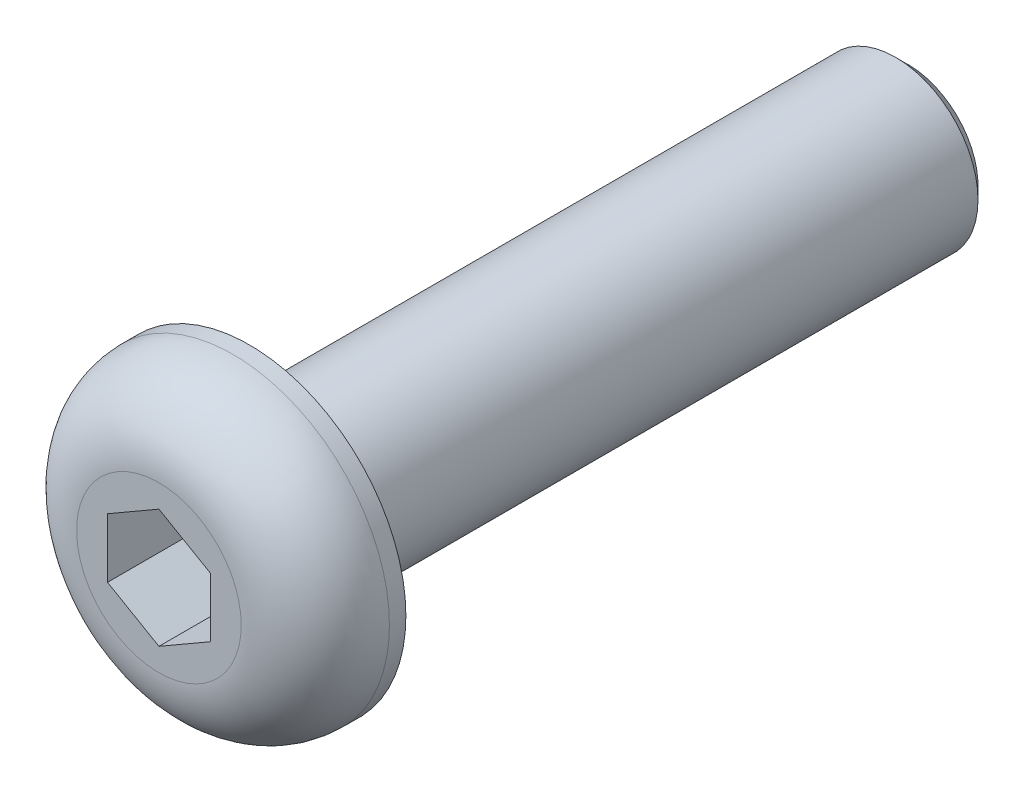
ISO-10303-21;
HEADER;
FILE_DESCRIPTION(('STEP AP214'),'2;1');
FILE_NAME('part.step','',(''),(''),'','','');
FILE_SCHEMA(('AUTOMOTIVE_DESIGN { 1 0 10303 214 1 1 1 1 }'));
ENDSEC;
DATA;
#1=APPLICATION_CONTEXT('core data for automotive mechanical design processes');
#2=APPLICATION_PROTOCOL_DEFINITION('international standard','automotive_design',2000,#1);
#3=PRODUCT_CONTEXT('',#1,'mechanical');
#4=PRODUCT('Part','Part','',(#3));
#5=PRODUCT_RELATED_PRODUCT_CATEGORY('part','',(#4));
#6=PRODUCT_DEFINITION_FORMATION('','',#4);
#7=PRODUCT_DEFINITION_CONTEXT('part definition',#1,'design');
#8=PRODUCT_DEFINITION('design','',#6,#7);
#9=PRODUCT_DEFINITION_SHAPE('','',#8);
#10=(LENGTH_UNIT() NAMED_UNIT(*) SI_UNIT(.MILLI.,.METRE.));
#11=(NAMED_UNIT(*) PLANE_ANGLE_UNIT() SI_UNIT($,.RADIAN.));
#12=(NAMED_UNIT(*) SI_UNIT($,.STERADIAN.) SOLID_ANGLE_UNIT());
#13=UNCERTAINTY_MEASURE_WITH_UNIT(LENGTH_MEASURE(1.E-05),#10,'distance_accuracy_value','');
#14=(GEOMETRIC_REPRESENTATION_CONTEXT(3) GLOBAL_UNCERTAINTY_ASSIGNED_CONTEXT((#13)) GLOBAL_UNIT_ASSIGNED_CONTEXT((#10,
#11,#12)) REPRESENTATION_CONTEXT('',''));
#15=CARTESIAN_POINT('',(0.,0.,0.));
#16=DIRECTION('',(0.,0.,1.));
#17=DIRECTION('',(1.,0.,0.));
#18=AXIS2_PLACEMENT_3D('',#15,#16,#17);
#19=CARTESIAN_POINT('',(0.,0.,0.));
#20=DIRECTION('',(0.,0.,1.));
#21=DIRECTION('',(1.,0.,0.));
#22=AXIS2_PLACEMENT_3D('',#19,#20,#21);
#23=PLANE('',#22);
#24=CARTESIAN_POINT('',(0.,0.,0.));
#25=DIRECTION('',(0.,0.,1.));
#26=DIRECTION('',(1.,0.,0.));
#27=AXIS2_PLACEMENT_3D('',#24,#25,#26);
#28=CIRCLE('',#27,3.8);
#29=CARTESIAN_POINT('',(3.8,0.,0.));
#30=VERTEX_POINT('',#29);
#31=EDGE_CURVE('E137',#30,#30,#28,.T.);
#32=ORIENTED_EDGE('',*,*,#31,.F.);
#33=EDGE_LOOP('',(#32));
#34=FACE_BOUND('',#33,.T.);
#35=CARTESIAN_POINT('',(0.,0.,0.));
#36=DIRECTION('',(0.,0.,1.));
#37=DIRECTION('',(1.,0.,0.));
#38=AXIS2_PLACEMENT_3D('',#35,#36,#37);
#39=CIRCLE('',#38,2.);
#40=CARTESIAN_POINT('',(2.,0.,0.));
#41=VERTEX_POINT('',#40);
#42=EDGE_CURVE('E145',#41,#41,#39,.F.);
#43=ORIENTED_EDGE('',*,*,#42,.F.);
#44=EDGE_LOOP('',(#43));
#45=FACE_BOUND('',#44,.T.);
#46=ADVANCED_FACE('F35',(#34,#45),#23,.F.);
#47=CARTESIAN_POINT('',(0.,0.,2.2));
#48=DIRECTION('',(0.,0.,-1.));
#49=DIRECTION('',(-1.,0.,0.));
#50=AXIS2_PLACEMENT_3D('',#47,#48,#49);
#51=CYLINDRICAL_SURFACE('',#50,3.8);
#52=CARTESIAN_POINT('',(0.,0.,0.4));
#53=DIRECTION('',(0.,0.,1.));
#54=DIRECTION('',(1.,0.,0.));
#55=AXIS2_PLACEMENT_3D('',#52,#53,#54);
#56=CIRCLE('',#55,3.8);
#57=CARTESIAN_POINT('',(3.8,0.,0.4));
#58=VERTEX_POINT('',#57);
#59=EDGE_CURVE('E11',#58,#58,#56,.F.);
#60=ORIENTED_EDGE('',*,*,#59,.T.);
#61=EDGE_LOOP('',(#60));
#62=FACE_BOUND('',#61,.T.);
#63=ORIENTED_EDGE('',*,*,#31,.T.);
#64=EDGE_LOOP('',(#63));
#65=FACE_BOUND('',#64,.T.);
#66=ADVANCED_FACE('F168',(#62,#65),#51,.T.);
#67=CARTESIAN_POINT('',(0.,0.,2.2));
#68=DIRECTION('',(0.,0.,1.));
#69=DIRECTION('',(1.,0.,0.));
#70=AXIS2_PLACEMENT_3D('',#67,#68,#69);
#71=PLANE('',#70);
#72=CARTESIAN_POINT('',(0.,0.,2.2));
#73=DIRECTION('',(0.,0.,1.));
#74=DIRECTION('',(1.,0.,0.));
#75=AXIS2_PLACEMENT_3D('',#72,#73,#74);
#76=CIRCLE('',#75,2.);
#77=CARTESIAN_POINT('',(2.,0.,2.2));
#78=VERTEX_POINT('',#77);
#79=EDGE_CURVE('E43',#78,#78,#76,.T.);
#80=ORIENTED_EDGE('',*,*,#79,.T.);
#81=EDGE_LOOP('',(#80));
#82=FACE_BOUND('',#81,.T.);
#83=DIRECTION('',(-0.866025403784439,0.5,0.));
#84=VECTOR('',#83,1.);
#85=CARTESIAN_POINT('',(1.25,0.721687836487033,2.2));
#86=LINE('',#85,#84);
#87=CARTESIAN_POINT('',(1.25,0.721687836487033,2.2));
#88=VERTEX_POINT('',#87);
#89=CARTESIAN_POINT('',(0.,1.44337567297406,2.2));
#90=VERTEX_POINT('',#89);
#91=EDGE_CURVE('E50',#88,#90,#86,.T.);
#92=ORIENTED_EDGE('',*,*,#91,.F.);
#93=DIRECTION('',(0.,1.,0.));
#94=VECTOR('',#93,1.);
#95=CARTESIAN_POINT('',(1.25,-0.721687836487033,2.2));
#96=LINE('',#95,#94);
#97=CARTESIAN_POINT('',(1.25,-0.721687836487033,2.2));
#98=VERTEX_POINT('',#97);
#99=EDGE_CURVE('E133',#98,#88,#96,.T.);
#100=ORIENTED_EDGE('',*,*,#99,.F.);
#101=DIRECTION('',(0.866025403784439,0.5,0.));
#102=VECTOR('',#101,1.);
#103=CARTESIAN_POINT('',(0.,-1.44337567297406,2.2));
#104=LINE('',#103,#102);
#105=CARTESIAN_POINT('',(0.,-1.44337567297406,2.2));
#106=VERTEX_POINT('',#105);
#107=EDGE_CURVE('E131',#106,#98,#104,.T.);
#108=ORIENTED_EDGE('',*,*,#107,.F.);
#109=DIRECTION('',(0.866025403784439,-0.5,0.));
#110=VECTOR('',#109,1.);
#111=CARTESIAN_POINT('',(-1.25,-0.721687836487032,2.2));
#112=LINE('',#111,#110);
#113=CARTESIAN_POINT('',(-1.25,-0.721687836487032,2.2));
#114=VERTEX_POINT('',#113);
#115=EDGE_CURVE('E98',#114,#106,#112,.T.);
#116=ORIENTED_EDGE('',*,*,#115,.F.);
#117=DIRECTION('',(0.,-1.,0.));
#118=VECTOR('',#117,1.);
#119=CARTESIAN_POINT('',(-1.25,0.721687836487033,2.2));
#120=LINE('',#119,#118);
#121=CARTESIAN_POINT('',(-1.25,0.721687836487033,2.2));
#122=VERTEX_POINT('',#121);
#123=EDGE_CURVE('E127',#122,#114,#120,.T.);
#124=ORIENTED_EDGE('',*,*,#123,.F.);
#125=DIRECTION('',(-0.866025403784439,-0.5,0.));
#126=VECTOR('',#125,1.);
#127=CARTESIAN_POINT('',(0.,1.44337567297406,2.2));
#128=LINE('',#127,#126);
#129=EDGE_CURVE('E124',#90,#122,#128,.T.);
#130=ORIENTED_EDGE('',*,*,#129,.F.);
#131=EDGE_LOOP('',(#92,#100,#108,#116,#124,#130));
#132=FACE_BOUND('',#131,.T.);
#133=ADVANCED_FACE('F156',(#82,#132),#71,.T.);
#134=CARTESIAN_POINT('',(0.,0.,-16.));
#135=DIRECTION('',(0.,0.,1.));
#136=DIRECTION('',(1.,0.,0.));
#137=AXIS2_PLACEMENT_3D('',#134,#135,#136);
#138=CYLINDRICAL_SURFACE('',#137,2.);
#139=CARTESIAN_POINT('',(0.,0.,-15.7));
#140=DIRECTION('',(0.,0.,-1.));
#141=DIRECTION('',(-1.,0.,0.));
#142=AXIS2_PLACEMENT_3D('',#139,#140,#141);
#143=CIRCLE('',#142,2.);
#144=CARTESIAN_POINT('',(-2.,0.,-15.7));
#145=VERTEX_POINT('',#144);
#146=EDGE_CURVE('E151',#145,#145,#143,.F.);
#147=ORIENTED_EDGE('',*,*,#146,.T.);
#148=EDGE_LOOP('',(#147));
#149=FACE_BOUND('',#148,.T.);
#150=ORIENTED_EDGE('',*,*,#42,.T.);
#151=EDGE_LOOP('',(#150));
#152=FACE_BOUND('',#151,.T.);
#153=ADVANCED_FACE('F191',(#149,#152),#138,.T.);
#154=CARTESIAN_POINT('',(0.,0.,-16.));
#155=DIRECTION('',(0.,0.,-1.));
#156=DIRECTION('',(-1.,0.,0.));
#157=AXIS2_PLACEMENT_3D('',#154,#155,#156);
#158=PLANE('',#157);
#159=CARTESIAN_POINT('',(0.,0.,-16.));
#160=DIRECTION('',(0.,0.,-1.));
#161=DIRECTION('',(-1.,0.,0.));
#162=AXIS2_PLACEMENT_3D('',#159,#160,#161);
#163=CIRCLE('',#162,1.70000000000001);
#164=CARTESIAN_POINT('',(-1.70000000000001,0.,-16.));
#165=VERTEX_POINT('',#164);
#166=EDGE_CURVE('E148',#165,#165,#163,.T.);
#167=ORIENTED_EDGE('',*,*,#166,.T.);
#168=EDGE_LOOP('',(#167));
#169=FACE_BOUND('',#168,.T.);
#170=ADVANCED_FACE('F183',(#169),#158,.T.);
#171=CARTESIAN_POINT('',(0.,0.,-16.));
#172=DIRECTION('',(0.,0.,1.));
#173=DIRECTION('',(1.,0.,0.));
#174=AXIS2_PLACEMENT_3D('',#171,#172,#173);
#175=CONICAL_SURFACE('',#174,1.70000000000001,0.785398163397443);
#176=ORIENTED_EDGE('',*,*,#146,.F.);
#177=EDGE_LOOP('',(#176));
#178=FACE_BOUND('',#177,.T.);
#179=ORIENTED_EDGE('',*,*,#166,.F.);
#180=EDGE_LOOP('',(#179));
#181=FACE_BOUND('',#180,.T.);
#182=ADVANCED_FACE('F180',(#178,#181),#175,.T.);
#183=CARTESIAN_POINT('',(1.25,0.721687836487033,0.2));
#184=DIRECTION('',(0.5,0.866025403784439,0.));
#185=DIRECTION('',(-0.866025403784439,0.5,0.));
#186=AXIS2_PLACEMENT_3D('',#183,#184,#185);
#187=PLANE('',#186);
#188=ORIENTED_EDGE('',*,*,#91,.T.);
#189=DIRECTION('',(0.,0.,1.));
#190=VECTOR('',#189,1.);
#191=CARTESIAN_POINT('',(0.,1.44337567297406,0.2));
#192=LINE('',#191,#190);
#193=CARTESIAN_POINT('',(0.,1.44337567297406,0.2));
#194=VERTEX_POINT('',#193);
#195=EDGE_CURVE('E80',#194,#90,#192,.T.);
#196=ORIENTED_EDGE('',*,*,#195,.F.);
#197=DIRECTION('',(-0.866025403784439,0.5,0.));
#198=VECTOR('',#197,1.);
#199=CARTESIAN_POINT('',(1.25,0.721687836487033,0.2));
#200=LINE('',#199,#198);
#201=CARTESIAN_POINT('',(1.25,0.721687836487033,0.2));
#202=VERTEX_POINT('',#201);
#203=EDGE_CURVE('E135',#202,#194,#200,.T.);
#204=ORIENTED_EDGE('',*,*,#203,.F.);
#205=DIRECTION('',(0.,0.,1.));
#206=VECTOR('',#205,1.);
#207=CARTESIAN_POINT('',(1.25,0.721687836487033,0.2));
#208=LINE('',#207,#206);
#209=EDGE_CURVE('E58',#202,#88,#208,.T.);
#210=ORIENTED_EDGE('',*,*,#209,.T.);
#211=EDGE_LOOP('',(#188,#196,#204,#210));
#212=FACE_BOUND('',#211,.T.);
#213=ADVANCED_FACE('F182',(#212),#187,.F.);
#214=CARTESIAN_POINT('',(1.25,-0.721687836487033,0.2));
#215=DIRECTION('',(1.,0.,0.));
#216=DIRECTION('',(0.,1.,0.));
#217=AXIS2_PLACEMENT_3D('',#214,#215,#216);
#218=PLANE('',#217);
#219=ORIENTED_EDGE('',*,*,#99,.T.);
#220=ORIENTED_EDGE('',*,*,#209,.F.);
#221=DIRECTION('',(0.,1.,0.));
#222=VECTOR('',#221,1.);
#223=CARTESIAN_POINT('',(1.25,-0.721687836487033,0.2));
#224=LINE('',#223,#222);
#225=CARTESIAN_POINT('',(1.25,-0.721687836487033,0.2));
#226=VERTEX_POINT('',#225);
#227=EDGE_CURVE('E110',#226,#202,#224,.T.);
#228=ORIENTED_EDGE('',*,*,#227,.F.);
#229=DIRECTION('',(0.,0.,1.));
#230=VECTOR('',#229,1.);
#231=CARTESIAN_POINT('',(1.25,-0.721687836487033,0.2));
#232=LINE('',#231,#230);
#233=EDGE_CURVE('E102',#226,#98,#232,.T.);
#234=ORIENTED_EDGE('',*,*,#233,.T.);
#235=EDGE_LOOP('',(#219,#220,#228,#234));
#236=FACE_BOUND('',#235,.T.);
#237=ADVANCED_FACE('F189',(#236),#218,.F.);
#238=CARTESIAN_POINT('',(0.,-1.44337567297406,0.2));
#239=DIRECTION('',(0.5,-0.866025403784439,0.));
#240=DIRECTION('',(0.866025403784439,0.5,0.));
#241=AXIS2_PLACEMENT_3D('',#238,#239,#240);
#242=PLANE('',#241);
#243=ORIENTED_EDGE('',*,*,#107,.T.);
#244=ORIENTED_EDGE('',*,*,#233,.F.);
#245=DIRECTION('',(0.866025403784439,0.5,0.));
#246=VECTOR('',#245,1.);
#247=CARTESIAN_POINT('',(0.,-1.44337567297406,0.2));
#248=LINE('',#247,#246);
#249=CARTESIAN_POINT('',(0.,-1.44337567297406,0.2));
#250=VERTEX_POINT('',#249);
#251=EDGE_CURVE('E106',#250,#226,#248,.T.);
#252=ORIENTED_EDGE('',*,*,#251,.F.);
#253=DIRECTION('',(0.,0.,1.));
#254=VECTOR('',#253,1.);
#255=CARTESIAN_POINT('',(0.,-1.44337567297406,0.2));
#256=LINE('',#255,#254);
#257=EDGE_CURVE('E91',#250,#106,#256,.T.);
#258=ORIENTED_EDGE('',*,*,#257,.T.);
#259=EDGE_LOOP('',(#243,#244,#252,#258));
#260=FACE_BOUND('',#259,.T.);
#261=ADVANCED_FACE('F107',(#260),#242,.F.);
#262=CARTESIAN_POINT('',(-1.25,-0.721687836487032,0.2));
#263=DIRECTION('',(-0.5,-0.866025403784439,0.));
#264=DIRECTION('',(0.866025403784439,-0.5,0.));
#265=AXIS2_PLACEMENT_3D('',#262,#263,#264);
#266=PLANE('',#265);
#267=ORIENTED_EDGE('',*,*,#115,.T.);
#268=ORIENTED_EDGE('',*,*,#257,.F.);
#269=DIRECTION('',(0.866025403784439,-0.5,0.));
#270=VECTOR('',#269,1.);
#271=CARTESIAN_POINT('',(-1.25,-0.721687836487032,0.2));
#272=LINE('',#271,#270);
#273=CARTESIAN_POINT('',(-1.25,-0.721687836487032,0.2));
#274=VERTEX_POINT('',#273);
#275=EDGE_CURVE('E95',#274,#250,#272,.T.);
#276=ORIENTED_EDGE('',*,*,#275,.F.);
#277=DIRECTION('',(0.,0.,1.));
#278=VECTOR('',#277,1.);
#279=CARTESIAN_POINT('',(-1.25,-0.721687836487032,0.2));
#280=LINE('',#279,#278);
#281=EDGE_CURVE('E103',#274,#114,#280,.T.);
#282=ORIENTED_EDGE('',*,*,#281,.T.);
#283=EDGE_LOOP('',(#267,#268,#276,#282));
#284=FACE_BOUND('',#283,.T.);
#285=ADVANCED_FACE('F93',(#284),#266,.F.);
#286=CARTESIAN_POINT('',(-1.25,0.721687836487033,0.2));
#287=DIRECTION('',(-1.,0.,0.));
#288=DIRECTION('',(0.,0.,1.));
#289=AXIS2_PLACEMENT_3D('',#286,#287,#288);
#290=PLANE('',#289);
#291=ORIENTED_EDGE('',*,*,#123,.T.);
#292=ORIENTED_EDGE('',*,*,#281,.F.);
#293=DIRECTION('',(0.,-1.,0.));
#294=VECTOR('',#293,1.);
#295=CARTESIAN_POINT('',(-1.25,0.721687836487033,0.2));
#296=LINE('',#295,#294);
#297=CARTESIAN_POINT('',(-1.25,0.721687836487033,0.2));
#298=VERTEX_POINT('',#297);
#299=EDGE_CURVE('E116',#298,#274,#296,.T.);
#300=ORIENTED_EDGE('',*,*,#299,.F.);
#301=DIRECTION('',(0.,0.,1.));
#302=VECTOR('',#301,1.);
#303=CARTESIAN_POINT('',(-1.25,0.721687836487033,0.2));
#304=LINE('',#303,#302);
#305=EDGE_CURVE('E140',#298,#122,#304,.T.);
#306=ORIENTED_EDGE('',*,*,#305,.T.);
#307=EDGE_LOOP('',(#291,#292,#300,#306));
#308=FACE_BOUND('',#307,.T.);
#309=ADVANCED_FACE('F207',(#308),#290,.F.);
#310=CARTESIAN_POINT('',(0.,1.44337567297406,0.2));
#311=DIRECTION('',(-0.5,0.866025403784439,0.));
#312=DIRECTION('',(-0.866025403784439,-0.5,0.));
#313=AXIS2_PLACEMENT_3D('',#310,#311,#312);
#314=PLANE('',#313);
#315=ORIENTED_EDGE('',*,*,#129,.T.);
#316=ORIENTED_EDGE('',*,*,#305,.F.);
#317=DIRECTION('',(-0.866025403784439,-0.5,0.));
#318=VECTOR('',#317,1.);
#319=CARTESIAN_POINT('',(0.,1.44337567297406,0.2));
#320=LINE('',#319,#318);
#321=EDGE_CURVE('E118',#194,#298,#320,.T.);
#322=ORIENTED_EDGE('',*,*,#321,.F.);
#323=ORIENTED_EDGE('',*,*,#195,.T.);
#324=EDGE_LOOP('',(#315,#316,#322,#323));
#325=FACE_BOUND('',#324,.T.);
#326=ADVANCED_FACE('F164',(#325),#314,.F.);
#327=CARTESIAN_POINT('',(0.,0.,0.2));
#328=DIRECTION('',(0.,0.,1.));
#329=DIRECTION('',(1.,0.,0.));
#330=AXIS2_PLACEMENT_3D('',#327,#328,#329);
#331=PLANE('',#330);
#332=ORIENTED_EDGE('',*,*,#203,.T.);
#333=ORIENTED_EDGE('',*,*,#321,.T.);
#334=ORIENTED_EDGE('',*,*,#299,.T.);
#335=ORIENTED_EDGE('',*,*,#275,.T.);
#336=ORIENTED_EDGE('',*,*,#251,.T.);
#337=ORIENTED_EDGE('',*,*,#227,.T.);
#338=EDGE_LOOP('',(#332,#333,#334,#335,#336,#337));
#339=FACE_BOUND('',#338,.T.);
#340=ADVANCED_FACE('F113',(#339),#331,.T.);
#341=CARTESIAN_POINT('',(0.,0.,0.4));
#342=DIRECTION('',(0.,0.,1.));
#343=DIRECTION('',(1.,0.,0.));
#344=AXIS2_PLACEMENT_3D('',#341,#342,#343);
#345=TOROIDAL_SURFACE('',#344,2.,1.8);
#346=ORIENTED_EDGE('',*,*,#59,.F.);
#347=EDGE_LOOP('',(#346));
#348=FACE_BOUND('',#347,.T.);
#349=ORIENTED_EDGE('',*,*,#79,.F.);
#350=EDGE_LOOP('',(#349));
#351=FACE_BOUND('',#350,.T.);
#352=ADVANCED_FACE('F37',(#348,#351),#345,.T.);
#353=CLOSED_SHELL('',(#46,#66,#133,#153,#170,#182,#213,#237,#261,#285,#309,#326,#340,#352));
#354=MANIFOLD_SOLID_BREP('B2',#353);
#355=ADVANCED_BREP_SHAPE_REPRESENTATION('',(#18,#354),#14);
#356=SHAPE_DEFINITION_REPRESENTATION(#9,#355);
ENDSEC;
END-ISO-10303-21;
